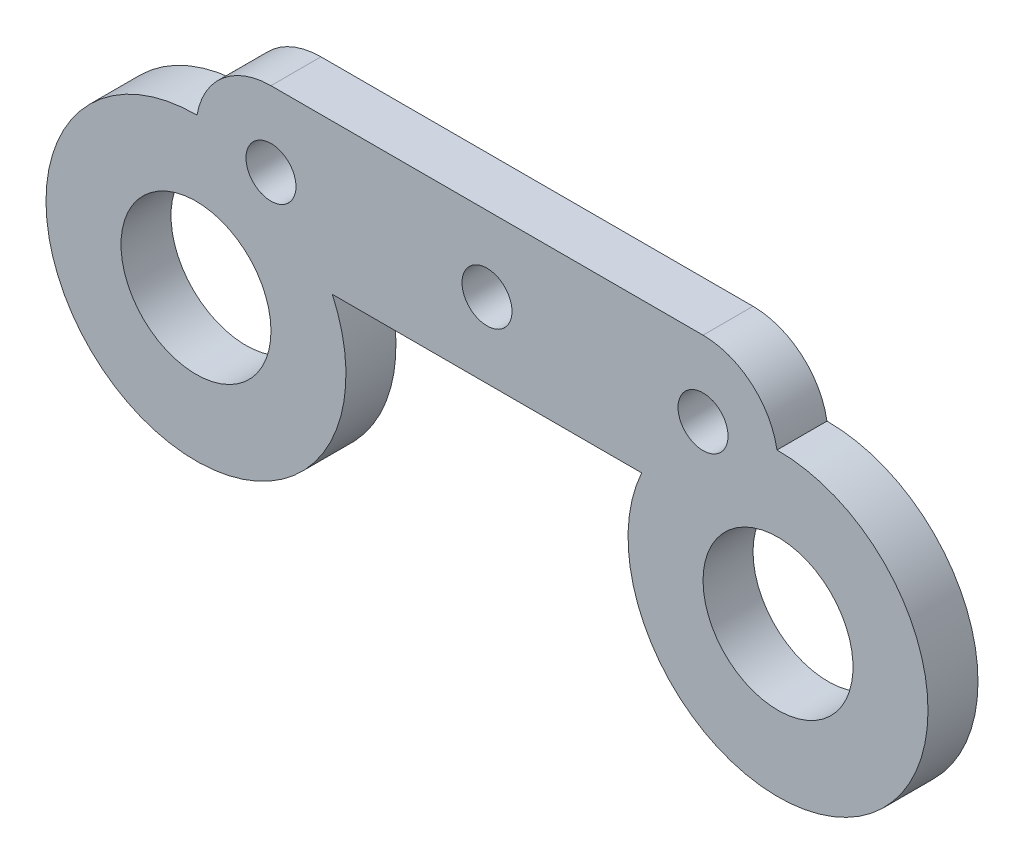
ISO-10303-21;
HEADER;
FILE_DESCRIPTION(('STEP AP214'),'2;1');
FILE_NAME('part.step','',(''),(''),'','','');
FILE_SCHEMA(('AUTOMOTIVE_DESIGN { 1 0 10303 214 1 1 1 1 }'));
ENDSEC;
DATA;
#1=APPLICATION_CONTEXT('core data for automotive mechanical design processes');
#2=APPLICATION_PROTOCOL_DEFINITION('international standard','automotive_design',2000,#1);
#3=PRODUCT_CONTEXT('',#1,'mechanical');
#4=PRODUCT('Part','Part','',(#3));
#5=PRODUCT_RELATED_PRODUCT_CATEGORY('part','',(#4));
#6=PRODUCT_DEFINITION_FORMATION('','',#4);
#7=PRODUCT_DEFINITION_CONTEXT('part definition',#1,'design');
#8=PRODUCT_DEFINITION('design','',#6,#7);
#9=PRODUCT_DEFINITION_SHAPE('','',#8);
#10=(LENGTH_UNIT() NAMED_UNIT(*) SI_UNIT(.MILLI.,.METRE.));
#11=(NAMED_UNIT(*) PLANE_ANGLE_UNIT() SI_UNIT($,.RADIAN.));
#12=(NAMED_UNIT(*) SI_UNIT($,.STERADIAN.) SOLID_ANGLE_UNIT());
#13=UNCERTAINTY_MEASURE_WITH_UNIT(LENGTH_MEASURE(1.E-05),#10,'distance_accuracy_value','');
#14=(GEOMETRIC_REPRESENTATION_CONTEXT(3) GLOBAL_UNCERTAINTY_ASSIGNED_CONTEXT((#13)) GLOBAL_UNIT_ASSIGNED_CONTEXT((#10,
#11,#12)) REPRESENTATION_CONTEXT('',''));
#15=CARTESIAN_POINT('',(0.,0.,0.));
#16=DIRECTION('',(0.,0.,1.));
#17=DIRECTION('',(1.,0.,0.));
#18=AXIS2_PLACEMENT_3D('',#15,#16,#17);
#19=CARTESIAN_POINT('',(-11.6421383013536,-5.50000000000006,2.));
#20=DIRECTION('',(0.,0.,1.));
#21=DIRECTION('',(1.,0.,0.));
#22=AXIS2_PLACEMENT_3D('',#19,#20,#21);
#23=PLANE('',#22);
#24=CARTESIAN_POINT('',(8.64213830135374,0.,2.));
#25=DIRECTION('',(0.,0.,1.));
#26=DIRECTION('',(-1.,0.,0.));
#27=AXIS2_PLACEMENT_3D('',#24,#25,#26);
#28=CIRCLE('',#27,1.00000000000005);
#29=CARTESIAN_POINT('',(7.64213830135369,0.,2.));
#30=VERTEX_POINT('',#29);
#31=EDGE_CURVE('E205',#30,#30,#28,.T.);
#32=ORIENTED_EDGE('',*,*,#31,.F.);
#33=EDGE_LOOP('',(#32));
#34=FACE_BOUND('',#33,.T.);
#35=CARTESIAN_POINT('',(-8.64213830135374,0.,2.));
#36=DIRECTION('',(0.,0.,1.));
#37=DIRECTION('',(1.,0.,0.));
#38=AXIS2_PLACEMENT_3D('',#35,#36,#37);
#39=CIRCLE('',#38,1.00000000000005);
#40=CARTESIAN_POINT('',(-7.64213830135369,0.,2.));
#41=VERTEX_POINT('',#40);
#42=EDGE_CURVE('E217',#41,#41,#39,.T.);
#43=ORIENTED_EDGE('',*,*,#42,.F.);
#44=EDGE_LOOP('',(#43));
#45=FACE_BOUND('',#44,.T.);
#46=CARTESIAN_POINT('',(-11.6421383013536,-5.50000000000006,2.));
#47=DIRECTION('',(0.,0.,1.));
#48=DIRECTION('',(1.,0.,0.));
#49=AXIS2_PLACEMENT_3D('',#46,#47,#48);
#50=CIRCLE('',#49,5.99999999999999);
#51=CARTESIAN_POINT('',(-11.6002029605603,0.499853450476246,2.));
#52=VERTEX_POINT('',#51);
#53=CARTESIAN_POINT('',(-6.18778224403582,-3.,2.));
#54=VERTEX_POINT('',#53);
#55=EDGE_CURVE('E129',#52,#54,#50,.T.);
#56=ORIENTED_EDGE('',*,*,#55,.T.);
#57=DIRECTION('',(1.,0.,0.));
#58=VECTOR('',#57,1.);
#59=CARTESIAN_POINT('',(-6.18778224403582,-3.,2.));
#60=LINE('',#59,#58);
#61=CARTESIAN_POINT('',(6.18778224403561,-3.00000000000001,2.));
#62=VERTEX_POINT('',#61);
#63=EDGE_CURVE('E87',#54,#62,#60,.T.);
#64=ORIENTED_EDGE('',*,*,#63,.T.);
#65=CARTESIAN_POINT('',(11.6421383013534,-5.50000000000006,2.));
#66=DIRECTION('',(0.,0.,1.));
#67=DIRECTION('',(1.,0.,0.));
#68=AXIS2_PLACEMENT_3D('',#65,#66,#67);
#69=CIRCLE('',#68,5.99999999999999);
#70=CARTESIAN_POINT('',(11.6002029605603,0.499853450476245,2.));
#71=VERTEX_POINT('',#70);
#72=EDGE_CURVE('E100',#62,#71,#69,.T.);
#73=ORIENTED_EDGE('',*,*,#72,.T.);
#74=CARTESIAN_POINT('',(8.64213830135374,0.,2.));
#75=DIRECTION('',(0.,0.,1.));
#76=DIRECTION('',(-1.,0.,0.));
#77=AXIS2_PLACEMENT_3D('',#74,#75,#76);
#78=CIRCLE('',#77,3.00000000000001);
#79=CARTESIAN_POINT('',(8.64213830135374,3.00000000000001,2.));
#80=VERTEX_POINT('',#79);
#81=EDGE_CURVE('E94',#71,#80,#78,.T.);
#82=ORIENTED_EDGE('',*,*,#81,.T.);
#83=DIRECTION('',(-1.,0.,0.));
#84=VECTOR('',#83,1.);
#85=CARTESIAN_POINT('',(-8.64213830135374,3.,2.));
#86=LINE('',#85,#84);
#87=CARTESIAN_POINT('',(-8.64213830135374,3.,2.));
#88=VERTEX_POINT('',#87);
#89=EDGE_CURVE('E98',#80,#88,#86,.T.);
#90=ORIENTED_EDGE('',*,*,#89,.T.);
#91=CARTESIAN_POINT('',(-8.64213830135374,0.,2.));
#92=DIRECTION('',(0.,0.,1.));
#93=DIRECTION('',(1.,0.,0.));
#94=AXIS2_PLACEMENT_3D('',#91,#92,#93);
#95=CIRCLE('',#94,3.00000000000001);
#96=EDGE_CURVE('E50',#88,#52,#95,.T.);
#97=ORIENTED_EDGE('',*,*,#96,.T.);
#98=EDGE_LOOP('',(#56,#64,#73,#82,#90,#97));
#99=FACE_BOUND('',#98,.T.);
#100=CARTESIAN_POINT('',(-11.6421383013536,-5.50000000000006,2.));
#101=DIRECTION('',(0.,0.,1.));
#102=DIRECTION('',(1.,0.,0.));
#103=AXIS2_PLACEMENT_3D('',#100,#101,#102);
#104=CIRCLE('',#103,2.99999999999999);
#105=CARTESIAN_POINT('',(-8.64213830135364,-5.50000000000006,2.));
#106=VERTEX_POINT('',#105);
#107=EDGE_CURVE('E122',#106,#106,#104,.T.);
#108=ORIENTED_EDGE('',*,*,#107,.F.);
#109=EDGE_LOOP('',(#108));
#110=FACE_BOUND('',#109,.T.);
#111=CARTESIAN_POINT('',(11.6421383013534,-5.50000000000006,2.));
#112=DIRECTION('',(0.,0.,1.));
#113=DIRECTION('',(-1.,0.,0.));
#114=AXIS2_PLACEMENT_3D('',#111,#112,#113);
#115=CIRCLE('',#114,3.0000000000013);
#116=CARTESIAN_POINT('',(8.64213830135214,-5.50000000000006,2.));
#117=VERTEX_POINT('',#116);
#118=EDGE_CURVE('E211',#117,#117,#115,.T.);
#119=ORIENTED_EDGE('',*,*,#118,.F.);
#120=EDGE_LOOP('',(#119));
#121=FACE_BOUND('',#120,.T.);
#122=CARTESIAN_POINT('',(0.,0.,2.));
#123=DIRECTION('',(0.,0.,1.));
#124=DIRECTION('',(1.,0.,0.));
#125=AXIS2_PLACEMENT_3D('',#122,#123,#124);
#126=CIRCLE('',#125,1.00000000000005);
#127=CARTESIAN_POINT('',(1.00000000000005,0.,2.));
#128=VERTEX_POINT('',#127);
#129=EDGE_CURVE('E197',#128,#128,#126,.T.);
#130=ORIENTED_EDGE('',*,*,#129,.F.);
#131=EDGE_LOOP('',(#130));
#132=FACE_BOUND('',#131,.T.);
#133=ADVANCED_FACE('F33',(#34,#45,#99,#110,#121,#132),#23,.T.);
#134=CARTESIAN_POINT('',(-11.6421383013536,-5.50000000000006,0.));
#135=DIRECTION('',(0.,0.,1.));
#136=DIRECTION('',(1.,0.,0.));
#137=AXIS2_PLACEMENT_3D('',#134,#135,#136);
#138=PLANE('',#137);
#139=CARTESIAN_POINT('',(8.64213830135374,0.,0.));
#140=DIRECTION('',(0.,0.,1.));
#141=DIRECTION('',(-1.,0.,0.));
#142=AXIS2_PLACEMENT_3D('',#139,#140,#141);
#143=CIRCLE('',#142,1.00000000000005);
#144=CARTESIAN_POINT('',(7.64213830135369,0.,0.));
#145=VERTEX_POINT('',#144);
#146=EDGE_CURVE('E203',#145,#145,#143,.T.);
#147=ORIENTED_EDGE('',*,*,#146,.T.);
#148=EDGE_LOOP('',(#147));
#149=FACE_BOUND('',#148,.T.);
#150=CARTESIAN_POINT('',(-8.64213830135374,0.,0.));
#151=DIRECTION('',(0.,0.,1.));
#152=DIRECTION('',(1.,0.,0.));
#153=AXIS2_PLACEMENT_3D('',#150,#151,#152);
#154=CIRCLE('',#153,1.00000000000005);
#155=CARTESIAN_POINT('',(-7.64213830135369,0.,0.));
#156=VERTEX_POINT('',#155);
#157=EDGE_CURVE('E214',#156,#156,#154,.T.);
#158=ORIENTED_EDGE('',*,*,#157,.T.);
#159=EDGE_LOOP('',(#158));
#160=FACE_BOUND('',#159,.T.);
#161=CARTESIAN_POINT('',(-11.6421383013536,-5.50000000000006,0.));
#162=DIRECTION('',(0.,0.,1.));
#163=DIRECTION('',(1.,0.,0.));
#164=AXIS2_PLACEMENT_3D('',#161,#162,#163);
#165=CIRCLE('',#164,5.99999999999999);
#166=CARTESIAN_POINT('',(-11.6002029605603,0.499853450476246,0.));
#167=VERTEX_POINT('',#166);
#168=CARTESIAN_POINT('',(-6.18778224403582,-3.,0.));
#169=VERTEX_POINT('',#168);
#170=EDGE_CURVE('E118',#167,#169,#165,.T.);
#171=ORIENTED_EDGE('',*,*,#170,.F.);
#172=CARTESIAN_POINT('',(-8.64213830135374,0.,0.));
#173=DIRECTION('',(0.,0.,1.));
#174=DIRECTION('',(1.,0.,0.));
#175=AXIS2_PLACEMENT_3D('',#172,#173,#174);
#176=CIRCLE('',#175,3.00000000000001);
#177=CARTESIAN_POINT('',(-8.64213830135374,3.,0.));
#178=VERTEX_POINT('',#177);
#179=EDGE_CURVE('E79',#178,#167,#176,.T.);
#180=ORIENTED_EDGE('',*,*,#179,.F.);
#181=DIRECTION('',(-1.,0.,0.));
#182=VECTOR('',#181,1.);
#183=CARTESIAN_POINT('',(-8.64213830135374,3.,0.));
#184=LINE('',#183,#182);
#185=CARTESIAN_POINT('',(8.64213830135374,3.00000000000001,0.));
#186=VERTEX_POINT('',#185);
#187=EDGE_CURVE('E73',#186,#178,#184,.T.);
#188=ORIENTED_EDGE('',*,*,#187,.F.);
#189=CARTESIAN_POINT('',(8.64213830135374,0.,0.));
#190=DIRECTION('',(0.,0.,1.));
#191=DIRECTION('',(-1.,0.,0.));
#192=AXIS2_PLACEMENT_3D('',#189,#190,#191);
#193=CIRCLE('',#192,3.00000000000001);
#194=CARTESIAN_POINT('',(11.6002029605603,0.499853450476245,0.));
#195=VERTEX_POINT('',#194);
#196=EDGE_CURVE('E108',#195,#186,#193,.T.);
#197=ORIENTED_EDGE('',*,*,#196,.F.);
#198=CARTESIAN_POINT('',(11.6421383013534,-5.50000000000006,0.));
#199=DIRECTION('',(0.,0.,1.));
#200=DIRECTION('',(1.,0.,0.));
#201=AXIS2_PLACEMENT_3D('',#198,#199,#200);
#202=CIRCLE('',#201,5.99999999999999);
#203=CARTESIAN_POINT('',(6.18778224403561,-3.00000000000001,0.));
#204=VERTEX_POINT('',#203);
#205=EDGE_CURVE('E124',#204,#195,#202,.T.);
#206=ORIENTED_EDGE('',*,*,#205,.F.);
#207=DIRECTION('',(1.,0.,0.));
#208=VECTOR('',#207,1.);
#209=CARTESIAN_POINT('',(-6.18778224403582,-3.,0.));
#210=LINE('',#209,#208);
#211=EDGE_CURVE('E121',#169,#204,#210,.T.);
#212=ORIENTED_EDGE('',*,*,#211,.F.);
#213=EDGE_LOOP('',(#171,#180,#188,#197,#206,#212));
#214=FACE_BOUND('',#213,.T.);
#215=CARTESIAN_POINT('',(-11.6421383013536,-5.50000000000006,0.));
#216=DIRECTION('',(0.,0.,1.));
#217=DIRECTION('',(1.,0.,0.));
#218=AXIS2_PLACEMENT_3D('',#215,#216,#217);
#219=CIRCLE('',#218,2.99999999999999);
#220=CARTESIAN_POINT('',(-8.64213830135364,-5.50000000000006,0.));
#221=VERTEX_POINT('',#220);
#222=EDGE_CURVE('E220',#221,#221,#219,.T.);
#223=ORIENTED_EDGE('',*,*,#222,.T.);
#224=EDGE_LOOP('',(#223));
#225=FACE_BOUND('',#224,.T.);
#226=CARTESIAN_POINT('',(11.6421383013534,-5.50000000000006,0.));
#227=DIRECTION('',(0.,0.,1.));
#228=DIRECTION('',(-1.,0.,0.));
#229=AXIS2_PLACEMENT_3D('',#226,#227,#228);
#230=CIRCLE('',#229,3.0000000000013);
#231=CARTESIAN_POINT('',(8.64213830135214,-5.50000000000006,0.));
#232=VERTEX_POINT('',#231);
#233=EDGE_CURVE('E208',#232,#232,#230,.T.);
#234=ORIENTED_EDGE('',*,*,#233,.T.);
#235=EDGE_LOOP('',(#234));
#236=FACE_BOUND('',#235,.T.);
#237=CARTESIAN_POINT('',(0.,0.,0.));
#238=DIRECTION('',(0.,0.,1.));
#239=DIRECTION('',(1.,0.,0.));
#240=AXIS2_PLACEMENT_3D('',#237,#238,#239);
#241=CIRCLE('',#240,1.00000000000005);
#242=CARTESIAN_POINT('',(1.00000000000005,0.,0.));
#243=VERTEX_POINT('',#242);
#244=EDGE_CURVE('E193',#243,#243,#241,.T.);
#245=ORIENTED_EDGE('',*,*,#244,.T.);
#246=EDGE_LOOP('',(#245));
#247=FACE_BOUND('',#246,.T.);
#248=ADVANCED_FACE('F138',(#149,#160,#214,#225,#236,#247),#138,.F.);
#249=CARTESIAN_POINT('',(-11.6421383013536,-5.50000000000006,2.));
#250=DIRECTION('',(0.,0.,-1.));
#251=DIRECTION('',(-1.,0.,0.));
#252=AXIS2_PLACEMENT_3D('',#249,#250,#251);
#253=CYLINDRICAL_SURFACE('',#252,5.99999999999999);
#254=ORIENTED_EDGE('',*,*,#170,.T.);
#255=DIRECTION('',(0.,0.,-1.));
#256=VECTOR('',#255,1.);
#257=CARTESIAN_POINT('',(-6.18778224403582,-3.,2.));
#258=LINE('',#257,#256);
#259=EDGE_CURVE('E11',#54,#169,#258,.T.);
#260=ORIENTED_EDGE('',*,*,#259,.F.);
#261=ORIENTED_EDGE('',*,*,#55,.F.);
#262=DIRECTION('',(0.,0.,-1.));
#263=VECTOR('',#262,1.);
#264=CARTESIAN_POINT('',(-11.6002029605603,0.499853450476246,2.));
#265=LINE('',#264,#263);
#266=EDGE_CURVE('E114',#52,#167,#265,.T.);
#267=ORIENTED_EDGE('',*,*,#266,.T.);
#268=EDGE_LOOP('',(#254,#260,#261,#267));
#269=FACE_BOUND('',#268,.T.);
#270=ADVANCED_FACE('F35',(#269),#253,.T.);
#271=CARTESIAN_POINT('',(-6.18778224403582,-3.,2.));
#272=DIRECTION('',(0.,1.,0.));
#273=DIRECTION('',(-1.,0.,0.));
#274=AXIS2_PLACEMENT_3D('',#271,#272,#273);
#275=PLANE('',#274);
#276=CARTESIAN_POINT('',(0.,-3.00000000000001,1.));
#277=DIRECTION('',(0.,-1.,0.));
#278=DIRECTION('',(0.,0.,-1.));
#279=AXIS2_PLACEMENT_3D('',#276,#277,#278);
#280=CIRCLE('',#279,0.5);
#281=CARTESIAN_POINT('',(0.,-3.00000000000001,0.5));
#282=VERTEX_POINT('',#281);
#283=EDGE_CURVE('E194',#282,#282,#280,.T.);
#284=ORIENTED_EDGE('',*,*,#283,.F.);
#285=EDGE_LOOP('',(#284));
#286=FACE_BOUND('',#285,.T.);
#287=ORIENTED_EDGE('',*,*,#211,.T.);
#288=DIRECTION('',(0.,0.,-1.));
#289=VECTOR('',#288,1.);
#290=CARTESIAN_POINT('',(6.18778224403561,-3.00000000000001,2.));
#291=LINE('',#290,#289);
#292=EDGE_CURVE('E42',#62,#204,#291,.T.);
#293=ORIENTED_EDGE('',*,*,#292,.F.);
#294=ORIENTED_EDGE('',*,*,#63,.F.);
#295=ORIENTED_EDGE('',*,*,#259,.T.);
#296=EDGE_LOOP('',(#287,#293,#294,#295));
#297=FACE_BOUND('',#296,.T.);
#298=ADVANCED_FACE('F250',(#286,#297),#275,.F.);
#299=CARTESIAN_POINT('',(11.6421383013534,-5.50000000000006,2.));
#300=DIRECTION('',(0.,0.,-1.));
#301=DIRECTION('',(-1.,0.,0.));
#302=AXIS2_PLACEMENT_3D('',#299,#300,#301);
#303=CYLINDRICAL_SURFACE('',#302,5.99999999999999);
#304=ORIENTED_EDGE('',*,*,#205,.T.);
#305=DIRECTION('',(0.,0.,-1.));
#306=VECTOR('',#305,1.);
#307=CARTESIAN_POINT('',(11.6002029605603,0.499853450476245,2.));
#308=LINE('',#307,#306);
#309=EDGE_CURVE('E109',#71,#195,#308,.T.);
#310=ORIENTED_EDGE('',*,*,#309,.F.);
#311=ORIENTED_EDGE('',*,*,#72,.F.);
#312=ORIENTED_EDGE('',*,*,#292,.T.);
#313=EDGE_LOOP('',(#304,#310,#311,#312));
#314=FACE_BOUND('',#313,.T.);
#315=ADVANCED_FACE('F135',(#314),#303,.T.);
#316=CARTESIAN_POINT('',(8.64213830135374,0.,2.));
#317=DIRECTION('',(0.,0.,-1.));
#318=DIRECTION('',(-1.,0.,0.));
#319=AXIS2_PLACEMENT_3D('',#316,#317,#318);
#320=CYLINDRICAL_SURFACE('',#319,3.00000000000001);
#321=ORIENTED_EDGE('',*,*,#196,.T.);
#322=DIRECTION('',(0.,0.,-1.));
#323=VECTOR('',#322,1.);
#324=CARTESIAN_POINT('',(8.64213830135374,3.00000000000001,2.));
#325=LINE('',#324,#323);
#326=EDGE_CURVE('E105',#80,#186,#325,.T.);
#327=ORIENTED_EDGE('',*,*,#326,.F.);
#328=ORIENTED_EDGE('',*,*,#81,.F.);
#329=ORIENTED_EDGE('',*,*,#309,.T.);
#330=EDGE_LOOP('',(#321,#327,#328,#329));
#331=FACE_BOUND('',#330,.T.);
#332=ADVANCED_FACE('F106',(#331),#320,.T.);
#333=CARTESIAN_POINT('',(-8.64213830135374,3.,2.));
#334=DIRECTION('',(0.,-1.,0.));
#335=DIRECTION('',(0.,0.,-1.));
#336=AXIS2_PLACEMENT_3D('',#333,#334,#335);
#337=PLANE('',#336);
#338=ORIENTED_EDGE('',*,*,#187,.T.);
#339=DIRECTION('',(0.,0.,-1.));
#340=VECTOR('',#339,1.);
#341=CARTESIAN_POINT('',(-8.64213830135374,3.,2.));
#342=LINE('',#341,#340);
#343=EDGE_CURVE('E110',#88,#178,#342,.T.);
#344=ORIENTED_EDGE('',*,*,#343,.F.);
#345=ORIENTED_EDGE('',*,*,#89,.F.);
#346=ORIENTED_EDGE('',*,*,#326,.T.);
#347=EDGE_LOOP('',(#338,#344,#345,#346));
#348=FACE_BOUND('',#347,.T.);
#349=ADVANCED_FACE('F112',(#348),#337,.F.);
#350=CARTESIAN_POINT('',(-8.64213830135374,0.,2.));
#351=DIRECTION('',(0.,0.,-1.));
#352=DIRECTION('',(-1.,0.,0.));
#353=AXIS2_PLACEMENT_3D('',#350,#351,#352);
#354=CYLINDRICAL_SURFACE('',#353,3.00000000000001);
#355=ORIENTED_EDGE('',*,*,#179,.T.);
#356=ORIENTED_EDGE('',*,*,#266,.F.);
#357=ORIENTED_EDGE('',*,*,#96,.F.);
#358=ORIENTED_EDGE('',*,*,#343,.T.);
#359=EDGE_LOOP('',(#355,#356,#357,#358));
#360=FACE_BOUND('',#359,.T.);
#361=ADVANCED_FACE('F143',(#360),#354,.T.);
#362=CARTESIAN_POINT('',(-11.6421383013536,-5.50000000000006,2.));
#363=DIRECTION('',(0.,0.,-1.));
#364=DIRECTION('',(-1.,0.,0.));
#365=AXIS2_PLACEMENT_3D('',#362,#363,#364);
#366=CYLINDRICAL_SURFACE('',#365,2.99999999999999);
#367=ORIENTED_EDGE('',*,*,#107,.T.);
#368=EDGE_LOOP('',(#367));
#369=FACE_BOUND('',#368,.T.);
#370=ORIENTED_EDGE('',*,*,#222,.F.);
#371=EDGE_LOOP('',(#370));
#372=FACE_BOUND('',#371,.T.);
#373=ADVANCED_FACE('F145',(#369,#372),#366,.F.);
#374=CARTESIAN_POINT('',(-8.64213830135374,0.,2.));
#375=DIRECTION('',(0.,0.,-1.));
#376=DIRECTION('',(-1.,0.,0.));
#377=AXIS2_PLACEMENT_3D('',#374,#375,#376);
#378=CYLINDRICAL_SURFACE('',#377,1.00000000000005);
#379=ORIENTED_EDGE('',*,*,#42,.T.);
#380=EDGE_LOOP('',(#379));
#381=FACE_BOUND('',#380,.T.);
#382=ORIENTED_EDGE('',*,*,#157,.F.);
#383=EDGE_LOOP('',(#382));
#384=FACE_BOUND('',#383,.T.);
#385=ADVANCED_FACE('F151',(#381,#384),#378,.F.);
#386=CARTESIAN_POINT('',(11.6421383013534,-5.50000000000006,2.));
#387=DIRECTION('',(0.,0.,-1.));
#388=DIRECTION('',(-1.,0.,0.));
#389=AXIS2_PLACEMENT_3D('',#386,#387,#388);
#390=CYLINDRICAL_SURFACE('',#389,3.0000000000013);
#391=ORIENTED_EDGE('',*,*,#118,.T.);
#392=EDGE_LOOP('',(#391));
#393=FACE_BOUND('',#392,.T.);
#394=ORIENTED_EDGE('',*,*,#233,.F.);
#395=EDGE_LOOP('',(#394));
#396=FACE_BOUND('',#395,.T.);
#397=ADVANCED_FACE('F168',(#393,#396),#390,.F.);
#398=CARTESIAN_POINT('',(8.64213830135374,0.,2.));
#399=DIRECTION('',(0.,0.,-1.));
#400=DIRECTION('',(-1.,0.,0.));
#401=AXIS2_PLACEMENT_3D('',#398,#399,#400);
#402=CYLINDRICAL_SURFACE('',#401,1.00000000000005);
#403=ORIENTED_EDGE('',*,*,#31,.T.);
#404=EDGE_LOOP('',(#403));
#405=FACE_BOUND('',#404,.T.);
#406=ORIENTED_EDGE('',*,*,#146,.F.);
#407=EDGE_LOOP('',(#406));
#408=FACE_BOUND('',#407,.T.);
#409=ADVANCED_FACE('F172',(#405,#408),#402,.F.);
#410=CARTESIAN_POINT('',(0.,0.,2.));
#411=DIRECTION('',(0.,0.,-1.));
#412=DIRECTION('',(-1.,0.,0.));
#413=AXIS2_PLACEMENT_3D('',#410,#411,#412);
#414=CYLINDRICAL_SURFACE('',#413,1.00000000000005);
#415=ORIENTED_EDGE('',*,*,#129,.T.);
#416=EDGE_LOOP('',(#415));
#417=FACE_BOUND('',#416,.T.);
#418=ORIENTED_EDGE('',*,*,#244,.F.);
#419=EDGE_LOOP('',(#418));
#420=FACE_BOUND('',#419,.T.);
#421=ADVANCED_FACE('F176',(#417,#420),#414,.F.);
#422=CARTESIAN_POINT('',(0.,-2.50000000000001,1.));
#423=DIRECTION('',(0.,-1.,0.));
#424=DIRECTION('',(0.,0.,-1.));
#425=AXIS2_PLACEMENT_3D('',#422,#423,#424);
#426=CYLINDRICAL_SURFACE('',#425,0.5);
#427=CARTESIAN_POINT('',(0.,-2.50000000000001,1.));
#428=DIRECTION('',(0.,-1.,0.));
#429=DIRECTION('',(0.,0.,-1.));
#430=AXIS2_PLACEMENT_3D('',#427,#428,#429);
#431=CIRCLE('',#430,0.5);
#432=CARTESIAN_POINT('',(0.,-2.50000000000001,0.5));
#433=VERTEX_POINT('',#432);
#434=EDGE_CURVE('E192',#433,#433,#431,.T.);
#435=ORIENTED_EDGE('',*,*,#434,.F.);
#436=EDGE_LOOP('',(#435));
#437=FACE_BOUND('',#436,.T.);
#438=ORIENTED_EDGE('',*,*,#283,.T.);
#439=EDGE_LOOP('',(#438));
#440=FACE_BOUND('',#439,.T.);
#441=ADVANCED_FACE('F180',(#437,#440),#426,.F.);
#442=CARTESIAN_POINT('',(0.,-2.50000000000001,1.));
#443=DIRECTION('',(0.,-1.,0.));
#444=DIRECTION('',(0.,0.,-1.));
#445=AXIS2_PLACEMENT_3D('',#442,#443,#444);
#446=PLANE('',#445);
#447=ORIENTED_EDGE('',*,*,#434,.T.);
#448=EDGE_LOOP('',(#447));
#449=FACE_BOUND('',#448,.T.);
#450=ADVANCED_FACE('F184',(#449),#446,.T.);
#451=CLOSED_SHELL('',(#133,#248,#270,#298,#315,#332,#349,#361,#373,#385,#397,#409,#421,#441,#450));
#452=MANIFOLD_SOLID_BREP('B2',#451);
#453=ADVANCED_BREP_SHAPE_REPRESENTATION('',(#18,#452),#14);
#454=SHAPE_DEFINITION_REPRESENTATION(#9,#453);
ENDSEC;
END-ISO-10303-21;
